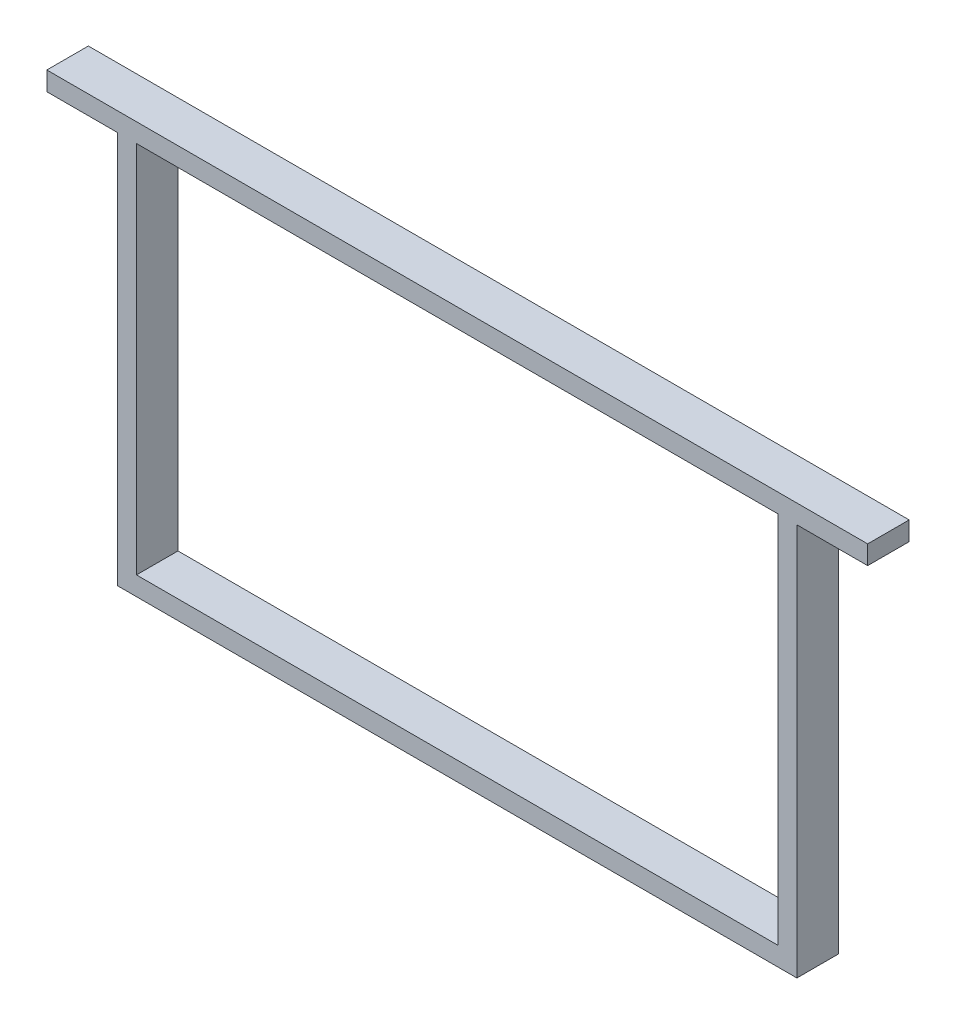
ISO-10303-21;
HEADER;
FILE_DESCRIPTION(('STEP AP214'),'2;1');
FILE_NAME('part.step','',(''),(''),'','','');
FILE_SCHEMA(('AUTOMOTIVE_DESIGN { 1 0 10303 214 1 1 1 1 }'));
ENDSEC;
DATA;
#1=APPLICATION_CONTEXT('core data for automotive mechanical design processes');
#2=APPLICATION_PROTOCOL_DEFINITION('international standard','automotive_design',2000,#1);
#3=PRODUCT_CONTEXT('',#1,'mechanical');
#4=PRODUCT('Part','Part','',(#3));
#5=PRODUCT_RELATED_PRODUCT_CATEGORY('part','',(#4));
#6=PRODUCT_DEFINITION_FORMATION('','',#4);
#7=PRODUCT_DEFINITION_CONTEXT('part definition',#1,'design');
#8=PRODUCT_DEFINITION('design','',#6,#7);
#9=PRODUCT_DEFINITION_SHAPE('','',#8);
#10=(LENGTH_UNIT() NAMED_UNIT(*) SI_UNIT(.MILLI.,.METRE.));
#11=(NAMED_UNIT(*) PLANE_ANGLE_UNIT() SI_UNIT($,.RADIAN.));
#12=(NAMED_UNIT(*) SI_UNIT($,.STERADIAN.) SOLID_ANGLE_UNIT());
#13=UNCERTAINTY_MEASURE_WITH_UNIT(LENGTH_MEASURE(1.E-05),#10,'distance_accuracy_value','');
#14=(GEOMETRIC_REPRESENTATION_CONTEXT(3) GLOBAL_UNCERTAINTY_ASSIGNED_CONTEXT((#13)) GLOBAL_UNIT_ASSIGNED_CONTEXT((#10,
#11,#12)) REPRESENTATION_CONTEXT('',''));
#15=CARTESIAN_POINT('',(0.,0.,0.));
#16=DIRECTION('',(0.,0.,1.));
#17=DIRECTION('',(1.,0.,0.));
#18=AXIS2_PLACEMENT_3D('',#15,#16,#17);
#19=CARTESIAN_POINT('',(0.,0.,22.));
#20=DIRECTION('',(0.,0.,-1.));
#21=DIRECTION('',(-1.,0.,0.));
#22=AXIS2_PLACEMENT_3D('',#19,#20,#21);
#23=PLANE('',#22);
#24=DIRECTION('',(0.,1.,0.));
#25=VECTOR('',#24,1.);
#26=CARTESIAN_POINT('',(217.5,109.,22.));
#27=LINE('',#26,#25);
#28=CARTESIAN_POINT('',(217.5,99.0000000000001,22.));
#29=VERTEX_POINT('',#28);
#30=CARTESIAN_POINT('',(217.5,109.,22.));
#31=VERTEX_POINT('',#30);
#32=EDGE_CURVE('E158',#29,#31,#27,.T.);
#33=ORIENTED_EDGE('',*,*,#32,.T.);
#34=DIRECTION('',(-1.,0.,0.));
#35=VECTOR('',#34,1.);
#36=CARTESIAN_POINT('',(-217.5,109.,22.));
#37=LINE('',#36,#35);
#38=CARTESIAN_POINT('',(-217.5,109.,22.));
#39=VERTEX_POINT('',#38);
#40=EDGE_CURVE('E161',#31,#39,#37,.T.);
#41=ORIENTED_EDGE('',*,*,#40,.T.);
#42=DIRECTION('',(0.,-1.,0.));
#43=VECTOR('',#42,1.);
#44=CARTESIAN_POINT('',(-217.5,99.,22.));
#45=LINE('',#44,#43);
#46=CARTESIAN_POINT('',(-217.5,99.,22.));
#47=VERTEX_POINT('',#46);
#48=EDGE_CURVE('E164',#39,#47,#45,.T.);
#49=ORIENTED_EDGE('',*,*,#48,.T.);
#50=DIRECTION('',(1.,0.,0.));
#51=VECTOR('',#50,1.);
#52=CARTESIAN_POINT('',(-180.,99.,22.));
#53=LINE('',#52,#51);
#54=CARTESIAN_POINT('',(-180.,99.,22.));
#55=VERTEX_POINT('',#54);
#56=EDGE_CURVE('E166',#47,#55,#53,.T.);
#57=ORIENTED_EDGE('',*,*,#56,.T.);
#58=DIRECTION('',(0.,-1.,0.));
#59=VECTOR('',#58,1.);
#60=CARTESIAN_POINT('',(-180.,-109.,22.));
#61=LINE('',#60,#59);
#62=CARTESIAN_POINT('',(-180.,-109.,22.));
#63=VERTEX_POINT('',#62);
#64=EDGE_CURVE('E168',#55,#63,#61,.T.);
#65=ORIENTED_EDGE('',*,*,#64,.T.);
#66=DIRECTION('',(1.,0.,0.));
#67=VECTOR('',#66,1.);
#68=CARTESIAN_POINT('',(180.,-109.,22.));
#69=LINE('',#68,#67);
#70=CARTESIAN_POINT('',(180.,-109.,22.));
#71=VERTEX_POINT('',#70);
#72=EDGE_CURVE('E170',#63,#71,#69,.T.);
#73=ORIENTED_EDGE('',*,*,#72,.T.);
#74=DIRECTION('',(0.,1.,0.));
#75=VECTOR('',#74,1.);
#76=CARTESIAN_POINT('',(180.,99.,22.));
#77=LINE('',#76,#75);
#78=CARTESIAN_POINT('',(180.,99.,22.));
#79=VERTEX_POINT('',#78);
#80=EDGE_CURVE('E172',#71,#79,#77,.T.);
#81=ORIENTED_EDGE('',*,*,#80,.T.);
#82=DIRECTION('',(1.,0.,0.));
#83=VECTOR('',#82,1.);
#84=CARTESIAN_POINT('',(217.5,99.0000000000001,22.));
#85=LINE('',#84,#83);
#86=EDGE_CURVE('E174',#79,#29,#85,.T.);
#87=ORIENTED_EDGE('',*,*,#86,.T.);
#88=EDGE_LOOP('',(#33,#41,#49,#57,#65,#73,#81,#87));
#89=FACE_BOUND('',#88,.T.);
#90=DIRECTION('',(0.,1.,0.));
#91=VECTOR('',#90,1.);
#92=CARTESIAN_POINT('',(170.,-99.,22.));
#93=LINE('',#92,#91);
#94=CARTESIAN_POINT('',(170.,-99.,22.));
#95=VERTEX_POINT('',#94);
#96=CARTESIAN_POINT('',(170.,99.,22.));
#97=VERTEX_POINT('',#96);
#98=EDGE_CURVE('E122',#95,#97,#93,.T.);
#99=ORIENTED_EDGE('',*,*,#98,.F.);
#100=DIRECTION('',(1.,0.,0.));
#101=VECTOR('',#100,1.);
#102=CARTESIAN_POINT('',(-170.,-99.,22.));
#103=LINE('',#102,#101);
#104=CARTESIAN_POINT('',(-170.,-99.,22.));
#105=VERTEX_POINT('',#104);
#106=EDGE_CURVE('E144',#105,#95,#103,.T.);
#107=ORIENTED_EDGE('',*,*,#106,.F.);
#108=DIRECTION('',(0.,-1.,0.));
#109=VECTOR('',#108,1.);
#110=CARTESIAN_POINT('',(-170.,-99.,22.));
#111=LINE('',#110,#109);
#112=CARTESIAN_POINT('',(-170.,99.,22.));
#113=VERTEX_POINT('',#112);
#114=EDGE_CURVE('E142',#113,#105,#111,.T.);
#115=ORIENTED_EDGE('',*,*,#114,.F.);
#116=DIRECTION('',(-1.,0.,0.));
#117=VECTOR('',#116,1.);
#118=CARTESIAN_POINT('',(-170.,99.,22.));
#119=LINE('',#118,#117);
#120=EDGE_CURVE('E130',#97,#113,#119,.T.);
#121=ORIENTED_EDGE('',*,*,#120,.F.);
#122=EDGE_LOOP('',(#99,#107,#115,#121));
#123=FACE_BOUND('',#122,.T.);
#124=ADVANCED_FACE('F33',(#89,#123),#23,.F.);
#125=CARTESIAN_POINT('',(0.,0.,0.));
#126=DIRECTION('',(0.,0.,-1.));
#127=DIRECTION('',(-1.,0.,0.));
#128=AXIS2_PLACEMENT_3D('',#125,#126,#127);
#129=PLANE('',#128);
#130=DIRECTION('',(0.,1.,0.));
#131=VECTOR('',#130,1.);
#132=CARTESIAN_POINT('',(217.5,109.,0.));
#133=LINE('',#132,#131);
#134=CARTESIAN_POINT('',(217.5,99.0000000000001,0.));
#135=VERTEX_POINT('',#134);
#136=CARTESIAN_POINT('',(217.5,109.,0.));
#137=VERTEX_POINT('',#136);
#138=EDGE_CURVE('E138',#135,#137,#133,.T.);
#139=ORIENTED_EDGE('',*,*,#138,.F.);
#140=DIRECTION('',(1.,0.,0.));
#141=VECTOR('',#140,1.);
#142=CARTESIAN_POINT('',(217.5,99.0000000000001,0.));
#143=LINE('',#142,#141);
#144=CARTESIAN_POINT('',(180.,99.,0.));
#145=VERTEX_POINT('',#144);
#146=EDGE_CURVE('E162',#145,#135,#143,.T.);
#147=ORIENTED_EDGE('',*,*,#146,.F.);
#148=DIRECTION('',(0.,1.,0.));
#149=VECTOR('',#148,1.);
#150=CARTESIAN_POINT('',(180.,99.,0.));
#151=LINE('',#150,#149);
#152=CARTESIAN_POINT('',(180.,-109.,0.));
#153=VERTEX_POINT('',#152);
#154=EDGE_CURVE('E189',#153,#145,#151,.T.);
#155=ORIENTED_EDGE('',*,*,#154,.F.);
#156=DIRECTION('',(1.,0.,0.));
#157=VECTOR('',#156,1.);
#158=CARTESIAN_POINT('',(180.,-109.,0.));
#159=LINE('',#158,#157);
#160=CARTESIAN_POINT('',(-180.,-109.,0.));
#161=VERTEX_POINT('',#160);
#162=EDGE_CURVE('E187',#161,#153,#159,.T.);
#163=ORIENTED_EDGE('',*,*,#162,.F.);
#164=DIRECTION('',(0.,-1.,0.));
#165=VECTOR('',#164,1.);
#166=CARTESIAN_POINT('',(-180.,-109.,0.));
#167=LINE('',#166,#165);
#168=CARTESIAN_POINT('',(-180.,99.,0.));
#169=VERTEX_POINT('',#168);
#170=EDGE_CURVE('E185',#169,#161,#167,.T.);
#171=ORIENTED_EDGE('',*,*,#170,.F.);
#172=DIRECTION('',(1.,0.,0.));
#173=VECTOR('',#172,1.);
#174=CARTESIAN_POINT('',(-180.,99.,0.));
#175=LINE('',#174,#173);
#176=CARTESIAN_POINT('',(-217.5,99.,0.));
#177=VERTEX_POINT('',#176);
#178=EDGE_CURVE('E183',#177,#169,#175,.T.);
#179=ORIENTED_EDGE('',*,*,#178,.F.);
#180=DIRECTION('',(0.,-1.,0.));
#181=VECTOR('',#180,1.);
#182=CARTESIAN_POINT('',(-217.5,99.,0.));
#183=LINE('',#182,#181);
#184=CARTESIAN_POINT('',(-217.5,109.,0.));
#185=VERTEX_POINT('',#184);
#186=EDGE_CURVE('E181',#185,#177,#183,.T.);
#187=ORIENTED_EDGE('',*,*,#186,.F.);
#188=DIRECTION('',(-1.,0.,0.));
#189=VECTOR('',#188,1.);
#190=CARTESIAN_POINT('',(-217.5,109.,0.));
#191=LINE('',#190,#189);
#192=EDGE_CURVE('E179',#137,#185,#191,.T.);
#193=ORIENTED_EDGE('',*,*,#192,.F.);
#194=EDGE_LOOP('',(#139,#147,#155,#163,#171,#179,#187,#193));
#195=FACE_BOUND('',#194,.T.);
#196=DIRECTION('',(1.,0.,0.));
#197=VECTOR('',#196,1.);
#198=CARTESIAN_POINT('',(-170.,-99.,0.));
#199=LINE('',#198,#197);
#200=CARTESIAN_POINT('',(-170.,-99.,0.));
#201=VERTEX_POINT('',#200);
#202=CARTESIAN_POINT('',(170.,-99.,0.));
#203=VERTEX_POINT('',#202);
#204=EDGE_CURVE('E131',#201,#203,#199,.T.);
#205=ORIENTED_EDGE('',*,*,#204,.T.);
#206=DIRECTION('',(0.,1.,0.));
#207=VECTOR('',#206,1.);
#208=CARTESIAN_POINT('',(170.,-99.,0.));
#209=LINE('',#208,#207);
#210=CARTESIAN_POINT('',(170.,99.,0.));
#211=VERTEX_POINT('',#210);
#212=EDGE_CURVE('E56',#203,#211,#209,.T.);
#213=ORIENTED_EDGE('',*,*,#212,.T.);
#214=DIRECTION('',(-1.,0.,0.));
#215=VECTOR('',#214,1.);
#216=CARTESIAN_POINT('',(-170.,99.,0.));
#217=LINE('',#216,#215);
#218=CARTESIAN_POINT('',(-170.,99.,0.));
#219=VERTEX_POINT('',#218);
#220=EDGE_CURVE('E137',#211,#219,#217,.T.);
#221=ORIENTED_EDGE('',*,*,#220,.T.);
#222=DIRECTION('',(0.,-1.,0.));
#223=VECTOR('',#222,1.);
#224=CARTESIAN_POINT('',(-170.,-99.,0.));
#225=LINE('',#224,#223);
#226=EDGE_CURVE('E150',#219,#201,#225,.T.);
#227=ORIENTED_EDGE('',*,*,#226,.T.);
#228=EDGE_LOOP('',(#205,#213,#221,#227));
#229=FACE_BOUND('',#228,.T.);
#230=ADVANCED_FACE('F219',(#195,#229),#129,.T.);
#231=CARTESIAN_POINT('',(217.5,109.,22.));
#232=DIRECTION('',(-1.,0.,0.));
#233=DIRECTION('',(0.,0.,1.));
#234=AXIS2_PLACEMENT_3D('',#231,#232,#233);
#235=PLANE('',#234);
#236=ORIENTED_EDGE('',*,*,#138,.T.);
#237=DIRECTION('',(0.,0.,-1.));
#238=VECTOR('',#237,1.);
#239=CARTESIAN_POINT('',(217.5,109.,22.));
#240=LINE('',#239,#238);
#241=EDGE_CURVE('E11',#31,#137,#240,.T.);
#242=ORIENTED_EDGE('',*,*,#241,.F.);
#243=ORIENTED_EDGE('',*,*,#32,.F.);
#244=DIRECTION('',(0.,0.,-1.));
#245=VECTOR('',#244,1.);
#246=CARTESIAN_POINT('',(217.5,99.0000000000001,22.));
#247=LINE('',#246,#245);
#248=EDGE_CURVE('E176',#29,#135,#247,.T.);
#249=ORIENTED_EDGE('',*,*,#248,.T.);
#250=EDGE_LOOP('',(#236,#242,#243,#249));
#251=FACE_BOUND('',#250,.T.);
#252=ADVANCED_FACE('F35',(#251),#235,.F.);
#253=CARTESIAN_POINT('',(-217.5,109.,22.));
#254=DIRECTION('',(0.,-1.,0.));
#255=DIRECTION('',(0.,0.,-1.));
#256=AXIS2_PLACEMENT_3D('',#253,#254,#255);
#257=PLANE('',#256);
#258=ORIENTED_EDGE('',*,*,#192,.T.);
#259=DIRECTION('',(0.,0.,-1.));
#260=VECTOR('',#259,1.);
#261=CARTESIAN_POINT('',(-217.5,109.,22.));
#262=LINE('',#261,#260);
#263=EDGE_CURVE('E41',#39,#185,#262,.T.);
#264=ORIENTED_EDGE('',*,*,#263,.F.);
#265=ORIENTED_EDGE('',*,*,#40,.F.);
#266=ORIENTED_EDGE('',*,*,#241,.T.);
#267=EDGE_LOOP('',(#258,#264,#265,#266));
#268=FACE_BOUND('',#267,.T.);
#269=ADVANCED_FACE('F236',(#268),#257,.F.);
#270=CARTESIAN_POINT('',(-217.5,99.,22.));
#271=DIRECTION('',(1.,0.,0.));
#272=DIRECTION('',(0.,0.,-1.));
#273=AXIS2_PLACEMENT_3D('',#270,#271,#272);
#274=PLANE('',#273);
#275=ORIENTED_EDGE('',*,*,#186,.T.);
#276=DIRECTION('',(0.,0.,-1.));
#277=VECTOR('',#276,1.);
#278=CARTESIAN_POINT('',(-217.5,99.,22.));
#279=LINE('',#278,#277);
#280=EDGE_CURVE('E206',#47,#177,#279,.T.);
#281=ORIENTED_EDGE('',*,*,#280,.F.);
#282=ORIENTED_EDGE('',*,*,#48,.F.);
#283=ORIENTED_EDGE('',*,*,#263,.T.);
#284=EDGE_LOOP('',(#275,#281,#282,#283));
#285=FACE_BOUND('',#284,.T.);
#286=ADVANCED_FACE('F213',(#285),#274,.F.);
#287=CARTESIAN_POINT('',(-180.,99.,22.));
#288=DIRECTION('',(0.,1.,0.));
#289=DIRECTION('',(0.,0.,1.));
#290=AXIS2_PLACEMENT_3D('',#287,#288,#289);
#291=PLANE('',#290);
#292=ORIENTED_EDGE('',*,*,#178,.T.);
#293=DIRECTION('',(0.,0.,-1.));
#294=VECTOR('',#293,1.);
#295=CARTESIAN_POINT('',(-180.,99.,22.));
#296=LINE('',#295,#294);
#297=EDGE_CURVE('E203',#55,#169,#296,.T.);
#298=ORIENTED_EDGE('',*,*,#297,.F.);
#299=ORIENTED_EDGE('',*,*,#56,.F.);
#300=ORIENTED_EDGE('',*,*,#280,.T.);
#301=EDGE_LOOP('',(#292,#298,#299,#300));
#302=FACE_BOUND('',#301,.T.);
#303=ADVANCED_FACE('F225',(#302),#291,.F.);
#304=CARTESIAN_POINT('',(-180.,-109.,22.));
#305=DIRECTION('',(1.,0.,0.));
#306=DIRECTION('',(0.,0.,-1.));
#307=AXIS2_PLACEMENT_3D('',#304,#305,#306);
#308=PLANE('',#307);
#309=ORIENTED_EDGE('',*,*,#170,.T.);
#310=DIRECTION('',(0.,0.,-1.));
#311=VECTOR('',#310,1.);
#312=CARTESIAN_POINT('',(-180.,-109.,22.));
#313=LINE('',#312,#311);
#314=EDGE_CURVE('E200',#63,#161,#313,.T.);
#315=ORIENTED_EDGE('',*,*,#314,.F.);
#316=ORIENTED_EDGE('',*,*,#64,.F.);
#317=ORIENTED_EDGE('',*,*,#297,.T.);
#318=EDGE_LOOP('',(#309,#315,#316,#317));
#319=FACE_BOUND('',#318,.T.);
#320=ADVANCED_FACE('F229',(#319),#308,.F.);
#321=CARTESIAN_POINT('',(180.,-109.,22.));
#322=DIRECTION('',(0.,1.,0.));
#323=DIRECTION('',(-1.,0.,0.));
#324=AXIS2_PLACEMENT_3D('',#321,#322,#323);
#325=PLANE('',#324);
#326=ORIENTED_EDGE('',*,*,#162,.T.);
#327=DIRECTION('',(0.,0.,-1.));
#328=VECTOR('',#327,1.);
#329=CARTESIAN_POINT('',(180.,-109.,22.));
#330=LINE('',#329,#328);
#331=EDGE_CURVE('E197',#71,#153,#330,.T.);
#332=ORIENTED_EDGE('',*,*,#331,.F.);
#333=ORIENTED_EDGE('',*,*,#72,.F.);
#334=ORIENTED_EDGE('',*,*,#314,.T.);
#335=EDGE_LOOP('',(#326,#332,#333,#334));
#336=FACE_BOUND('',#335,.T.);
#337=ADVANCED_FACE('F249',(#336),#325,.F.);
#338=CARTESIAN_POINT('',(180.,99.,22.));
#339=DIRECTION('',(-1.,0.,0.));
#340=DIRECTION('',(0.,-1.,0.));
#341=AXIS2_PLACEMENT_3D('',#338,#339,#340);
#342=PLANE('',#341);
#343=ORIENTED_EDGE('',*,*,#154,.T.);
#344=DIRECTION('',(0.,0.,-1.));
#345=VECTOR('',#344,1.);
#346=CARTESIAN_POINT('',(180.,99.,22.));
#347=LINE('',#346,#345);
#348=EDGE_CURVE('E194',#79,#145,#347,.T.);
#349=ORIENTED_EDGE('',*,*,#348,.F.);
#350=ORIENTED_EDGE('',*,*,#80,.F.);
#351=ORIENTED_EDGE('',*,*,#331,.T.);
#352=EDGE_LOOP('',(#343,#349,#350,#351));
#353=FACE_BOUND('',#352,.T.);
#354=ADVANCED_FACE('F247',(#353),#342,.F.);
#355=CARTESIAN_POINT('',(217.5,99.0000000000001,22.));
#356=DIRECTION('',(0.,1.,0.));
#357=DIRECTION('',(-1.,0.,0.));
#358=AXIS2_PLACEMENT_3D('',#355,#356,#357);
#359=PLANE('',#358);
#360=ORIENTED_EDGE('',*,*,#146,.T.);
#361=ORIENTED_EDGE('',*,*,#248,.F.);
#362=ORIENTED_EDGE('',*,*,#86,.F.);
#363=ORIENTED_EDGE('',*,*,#348,.T.);
#364=EDGE_LOOP('',(#360,#361,#362,#363));
#365=FACE_BOUND('',#364,.T.);
#366=ADVANCED_FACE('F242',(#365),#359,.F.);
#367=CARTESIAN_POINT('',(170.,-99.,22.));
#368=DIRECTION('',(-1.,0.,0.));
#369=DIRECTION('',(0.,-1.,0.));
#370=AXIS2_PLACEMENT_3D('',#367,#368,#369);
#371=PLANE('',#370);
#372=ORIENTED_EDGE('',*,*,#212,.F.);
#373=DIRECTION('',(0.,0.,-1.));
#374=VECTOR('',#373,1.);
#375=CARTESIAN_POINT('',(170.,-99.,22.));
#376=LINE('',#375,#374);
#377=EDGE_CURVE('E126',#95,#203,#376,.T.);
#378=ORIENTED_EDGE('',*,*,#377,.F.);
#379=ORIENTED_EDGE('',*,*,#98,.T.);
#380=DIRECTION('',(0.,0.,-1.));
#381=VECTOR('',#380,1.);
#382=CARTESIAN_POINT('',(170.,99.,22.));
#383=LINE('',#382,#381);
#384=EDGE_CURVE('E125',#97,#211,#383,.T.);
#385=ORIENTED_EDGE('',*,*,#384,.T.);
#386=EDGE_LOOP('',(#372,#378,#379,#385));
#387=FACE_BOUND('',#386,.T.);
#388=ADVANCED_FACE('F124',(#387),#371,.T.);
#389=CARTESIAN_POINT('',(-170.,99.,22.));
#390=DIRECTION('',(0.,-1.,0.));
#391=DIRECTION('',(0.,0.,-1.));
#392=AXIS2_PLACEMENT_3D('',#389,#390,#391);
#393=PLANE('',#392);
#394=ORIENTED_EDGE('',*,*,#220,.F.);
#395=ORIENTED_EDGE('',*,*,#384,.F.);
#396=ORIENTED_EDGE('',*,*,#120,.T.);
#397=DIRECTION('',(0.,0.,-1.));
#398=VECTOR('',#397,1.);
#399=CARTESIAN_POINT('',(-170.,99.,22.));
#400=LINE('',#399,#398);
#401=EDGE_CURVE('E139',#113,#219,#400,.T.);
#402=ORIENTED_EDGE('',*,*,#401,.T.);
#403=EDGE_LOOP('',(#394,#395,#396,#402));
#404=FACE_BOUND('',#403,.T.);
#405=ADVANCED_FACE('F134',(#404),#393,.T.);
#406=CARTESIAN_POINT('',(-170.,-99.,22.));
#407=DIRECTION('',(1.,0.,0.));
#408=DIRECTION('',(0.,1.,0.));
#409=AXIS2_PLACEMENT_3D('',#406,#407,#408);
#410=PLANE('',#409);
#411=ORIENTED_EDGE('',*,*,#226,.F.);
#412=ORIENTED_EDGE('',*,*,#401,.F.);
#413=ORIENTED_EDGE('',*,*,#114,.T.);
#414=DIRECTION('',(0.,0.,-1.));
#415=VECTOR('',#414,1.);
#416=CARTESIAN_POINT('',(-170.,-99.,22.));
#417=LINE('',#416,#415);
#418=EDGE_CURVE('E48',#105,#201,#417,.T.);
#419=ORIENTED_EDGE('',*,*,#418,.T.);
#420=EDGE_LOOP('',(#411,#412,#413,#419));
#421=FACE_BOUND('',#420,.T.);
#422=ADVANCED_FACE('F274',(#421),#410,.T.);
#423=CARTESIAN_POINT('',(-170.,-99.,22.));
#424=DIRECTION('',(0.,1.,0.));
#425=DIRECTION('',(-1.,0.,0.));
#426=AXIS2_PLACEMENT_3D('',#423,#424,#425);
#427=PLANE('',#426);
#428=ORIENTED_EDGE('',*,*,#204,.F.);
#429=ORIENTED_EDGE('',*,*,#418,.F.);
#430=ORIENTED_EDGE('',*,*,#106,.T.);
#431=ORIENTED_EDGE('',*,*,#377,.T.);
#432=EDGE_LOOP('',(#428,#429,#430,#431));
#433=FACE_BOUND('',#432,.T.);
#434=ADVANCED_FACE('F278',(#433),#427,.T.);
#435=CLOSED_SHELL('',(#124,#230,#252,#269,#286,#303,#320,#337,#354,#366,#388,#405,#422,#434));
#436=MANIFOLD_SOLID_BREP('B2',#435);
#437=ADVANCED_BREP_SHAPE_REPRESENTATION('',(#18,#436),#14);
#438=SHAPE_DEFINITION_REPRESENTATION(#9,#437);
ENDSEC;
END-ISO-10303-21;
